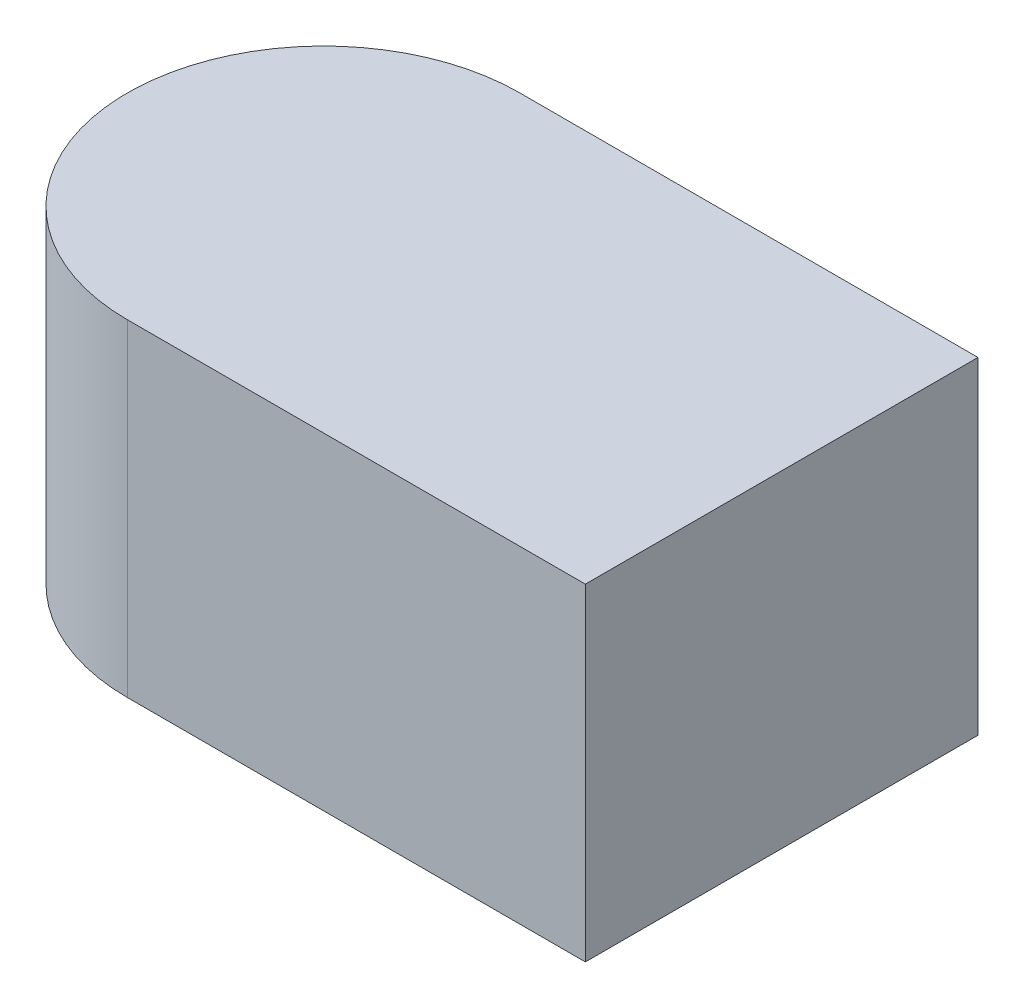
ISO-10303-21;
HEADER;
FILE_DESCRIPTION(('STEP AP214'),'2;1');
FILE_NAME('part.step','',(''),(''),'','','');
FILE_SCHEMA(('AUTOMOTIVE_DESIGN { 1 0 10303 214 1 1 1 1 }'));
ENDSEC;
DATA;
#1=APPLICATION_CONTEXT('core data for automotive mechanical design processes');
#2=APPLICATION_PROTOCOL_DEFINITION('international standard','automotive_design',2000,#1);
#3=PRODUCT_CONTEXT('',#1,'mechanical');
#4=PRODUCT('Part','Part','',(#3));
#5=PRODUCT_RELATED_PRODUCT_CATEGORY('part','',(#4));
#6=PRODUCT_DEFINITION_FORMATION('','',#4);
#7=PRODUCT_DEFINITION_CONTEXT('part definition',#1,'design');
#8=PRODUCT_DEFINITION('design','',#6,#7);
#9=PRODUCT_DEFINITION_SHAPE('','',#8);
#10=(LENGTH_UNIT() NAMED_UNIT(*) SI_UNIT(.MILLI.,.METRE.));
#11=(NAMED_UNIT(*) PLANE_ANGLE_UNIT() SI_UNIT($,.RADIAN.));
#12=(NAMED_UNIT(*) SI_UNIT($,.STERADIAN.) SOLID_ANGLE_UNIT());
#13=UNCERTAINTY_MEASURE_WITH_UNIT(LENGTH_MEASURE(1.E-05),#10,'distance_accuracy_value','');
#14=(GEOMETRIC_REPRESENTATION_CONTEXT(3) GLOBAL_UNCERTAINTY_ASSIGNED_CONTEXT((#13)) GLOBAL_UNIT_ASSIGNED_CONTEXT((#10,
#11,#12)) REPRESENTATION_CONTEXT('',''));
#15=CARTESIAN_POINT('',(0.,0.,0.));
#16=DIRECTION('',(0.,0.,1.));
#17=DIRECTION('',(1.,0.,0.));
#18=AXIS2_PLACEMENT_3D('',#15,#16,#17);
#19=CARTESIAN_POINT('',(0.,0.,0.));
#20=DIRECTION('',(0.,1.,0.));
#21=DIRECTION('',(1.,0.,0.));
#22=AXIS2_PLACEMENT_3D('',#19,#20,#21);
#23=PLANE('',#22);
#24=DIRECTION('',(0.,0.,-1.));
#25=VECTOR('',#24,1.);
#26=CARTESIAN_POINT('',(1.75,0.,-1.13));
#27=LINE('',#26,#25);
#28=CARTESIAN_POINT('',(1.75,0.,-1.13));
#29=VERTEX_POINT('',#28);
#30=CARTESIAN_POINT('',(1.75,0.,-1.37));
#31=VERTEX_POINT('',#30);
#32=EDGE_CURVE('E11',#29,#31,#27,.T.);
#33=ORIENTED_EDGE('',*,*,#32,.F.);
#34=DIRECTION('',(1.,0.,0.));
#35=VECTOR('',#34,1.);
#36=CARTESIAN_POINT('',(1.47,0.,-1.13));
#37=LINE('',#36,#35);
#38=CARTESIAN_POINT('',(1.47,0.,-1.13));
#39=VERTEX_POINT('',#38);
#40=EDGE_CURVE('E24',#39,#29,#37,.T.);
#41=ORIENTED_EDGE('',*,*,#40,.F.);
#42=CARTESIAN_POINT('',(1.47,0.,-1.25));
#43=DIRECTION('',(0.,1.,0.));
#44=DIRECTION('',(0.,0.,-1.));
#45=AXIS2_PLACEMENT_3D('',#42,#43,#44);
#46=CIRCLE('',#45,0.12);
#47=CARTESIAN_POINT('',(1.47,0.,-1.37));
#48=VERTEX_POINT('',#47);
#49=EDGE_CURVE('E61',#48,#39,#46,.T.);
#50=ORIENTED_EDGE('',*,*,#49,.F.);
#51=DIRECTION('',(-1.,0.,0.));
#52=VECTOR('',#51,1.);
#53=CARTESIAN_POINT('',(1.75,0.,-1.37));
#54=LINE('',#53,#52);
#55=EDGE_CURVE('E37',#31,#48,#54,.T.);
#56=ORIENTED_EDGE('',*,*,#55,.F.);
#57=EDGE_LOOP('',(#33,#41,#50,#56));
#58=FACE_BOUND('',#57,.T.);
#59=ADVANCED_FACE('F17',(#58),#23,.F.);
#60=CARTESIAN_POINT('',(1.75,0.,-1.37));
#61=DIRECTION('',(0.,0.,-1.));
#62=DIRECTION('',(-1.,0.,0.));
#63=AXIS2_PLACEMENT_3D('',#60,#61,#62);
#64=PLANE('',#63);
#65=DIRECTION('',(0.,1.,0.));
#66=VECTOR('',#65,1.);
#67=CARTESIAN_POINT('',(1.47,0.,-1.37));
#68=LINE('',#67,#66);
#69=CARTESIAN_POINT('',(1.47,0.2,-1.37));
#70=VERTEX_POINT('',#69);
#71=EDGE_CURVE('E84',#48,#70,#68,.T.);
#72=ORIENTED_EDGE('',*,*,#71,.T.);
#73=DIRECTION('',(-1.,0.,0.));
#74=VECTOR('',#73,1.);
#75=CARTESIAN_POINT('',(1.75,0.2,-1.37));
#76=LINE('',#75,#74);
#77=CARTESIAN_POINT('',(1.75,0.2,-1.37));
#78=VERTEX_POINT('',#77);
#79=EDGE_CURVE('E74',#78,#70,#76,.T.);
#80=ORIENTED_EDGE('',*,*,#79,.F.);
#81=DIRECTION('',(0.,1.,0.));
#82=VECTOR('',#81,1.);
#83=CARTESIAN_POINT('',(1.75,0.,-1.37));
#84=LINE('',#83,#82);
#85=EDGE_CURVE('E81',#31,#78,#84,.T.);
#86=ORIENTED_EDGE('',*,*,#85,.F.);
#87=ORIENTED_EDGE('',*,*,#55,.T.);
#88=EDGE_LOOP('',(#72,#80,#86,#87));
#89=FACE_BOUND('',#88,.T.);
#90=ADVANCED_FACE('F89',(#89),#64,.T.);
#91=CARTESIAN_POINT('',(1.75,0.,-1.13));
#92=DIRECTION('',(1.,0.,0.));
#93=DIRECTION('',(0.,0.,-1.));
#94=AXIS2_PLACEMENT_3D('',#91,#92,#93);
#95=PLANE('',#94);
#96=ORIENTED_EDGE('',*,*,#85,.T.);
#97=DIRECTION('',(0.,0.,-1.));
#98=VECTOR('',#97,1.);
#99=CARTESIAN_POINT('',(1.75,0.2,-1.13));
#100=LINE('',#99,#98);
#101=CARTESIAN_POINT('',(1.75,0.2,-1.13));
#102=VERTEX_POINT('',#101);
#103=EDGE_CURVE('E79',#102,#78,#100,.T.);
#104=ORIENTED_EDGE('',*,*,#103,.F.);
#105=DIRECTION('',(0.,1.,0.));
#106=VECTOR('',#105,1.);
#107=CARTESIAN_POINT('',(1.75,0.,-1.13));
#108=LINE('',#107,#106);
#109=EDGE_CURVE('E67',#29,#102,#108,.T.);
#110=ORIENTED_EDGE('',*,*,#109,.F.);
#111=ORIENTED_EDGE('',*,*,#32,.T.);
#112=EDGE_LOOP('',(#96,#104,#110,#111));
#113=FACE_BOUND('',#112,.T.);
#114=ADVANCED_FACE('F91',(#113),#95,.T.);
#115=CARTESIAN_POINT('',(1.47,0.,-1.13));
#116=DIRECTION('',(0.,0.,1.));
#117=DIRECTION('',(1.,0.,0.));
#118=AXIS2_PLACEMENT_3D('',#115,#116,#117);
#119=PLANE('',#118);
#120=ORIENTED_EDGE('',*,*,#109,.T.);
#121=DIRECTION('',(1.,0.,0.));
#122=VECTOR('',#121,1.);
#123=CARTESIAN_POINT('',(1.47,0.2,-1.13));
#124=LINE('',#123,#122);
#125=CARTESIAN_POINT('',(1.47,0.2,-1.13));
#126=VERTEX_POINT('',#125);
#127=EDGE_CURVE('E62',#126,#102,#124,.T.);
#128=ORIENTED_EDGE('',*,*,#127,.F.);
#129=DIRECTION('',(0.,1.,0.));
#130=VECTOR('',#129,1.);
#131=CARTESIAN_POINT('',(1.47,0.,-1.13));
#132=LINE('',#131,#130);
#133=EDGE_CURVE('E55',#39,#126,#132,.T.);
#134=ORIENTED_EDGE('',*,*,#133,.F.);
#135=ORIENTED_EDGE('',*,*,#40,.T.);
#136=EDGE_LOOP('',(#120,#128,#134,#135));
#137=FACE_BOUND('',#136,.T.);
#138=ADVANCED_FACE('F65',(#137),#119,.T.);
#139=CARTESIAN_POINT('',(1.47,0.,-1.25));
#140=DIRECTION('',(0.,1.,0.));
#141=DIRECTION('',(1.,0.,0.));
#142=AXIS2_PLACEMENT_3D('',#139,#140,#141);
#143=CYLINDRICAL_SURFACE('',#142,0.12);
#144=ORIENTED_EDGE('',*,*,#133,.T.);
#145=CARTESIAN_POINT('',(1.47,0.2,-1.25));
#146=DIRECTION('',(0.,1.,0.));
#147=DIRECTION('',(0.,0.,-1.));
#148=AXIS2_PLACEMENT_3D('',#145,#146,#147);
#149=CIRCLE('',#148,0.12);
#150=EDGE_CURVE('E60',#70,#126,#149,.T.);
#151=ORIENTED_EDGE('',*,*,#150,.F.);
#152=ORIENTED_EDGE('',*,*,#71,.F.);
#153=ORIENTED_EDGE('',*,*,#49,.T.);
#154=EDGE_LOOP('',(#144,#151,#152,#153));
#155=FACE_BOUND('',#154,.T.);
#156=ADVANCED_FACE('F57',(#155),#143,.T.);
#157=CARTESIAN_POINT('',(0.,0.2,0.));
#158=DIRECTION('',(0.,1.,0.));
#159=DIRECTION('',(1.,0.,0.));
#160=AXIS2_PLACEMENT_3D('',#157,#158,#159);
#161=PLANE('',#160);
#162=ORIENTED_EDGE('',*,*,#150,.T.);
#163=ORIENTED_EDGE('',*,*,#127,.T.);
#164=ORIENTED_EDGE('',*,*,#103,.T.);
#165=ORIENTED_EDGE('',*,*,#79,.T.);
#166=EDGE_LOOP('',(#162,#163,#164,#165));
#167=FACE_BOUND('',#166,.T.);
#168=ADVANCED_FACE('F72',(#167),#161,.T.);
#169=CLOSED_SHELL('',(#59,#90,#114,#138,#156,#168));
#170=MANIFOLD_SOLID_BREP('B1',#169);
#171=ADVANCED_BREP_SHAPE_REPRESENTATION('',(#18,#170),#14);
#172=SHAPE_DEFINITION_REPRESENTATION(#9,#171);
ENDSEC;
END-ISO-10303-21;
